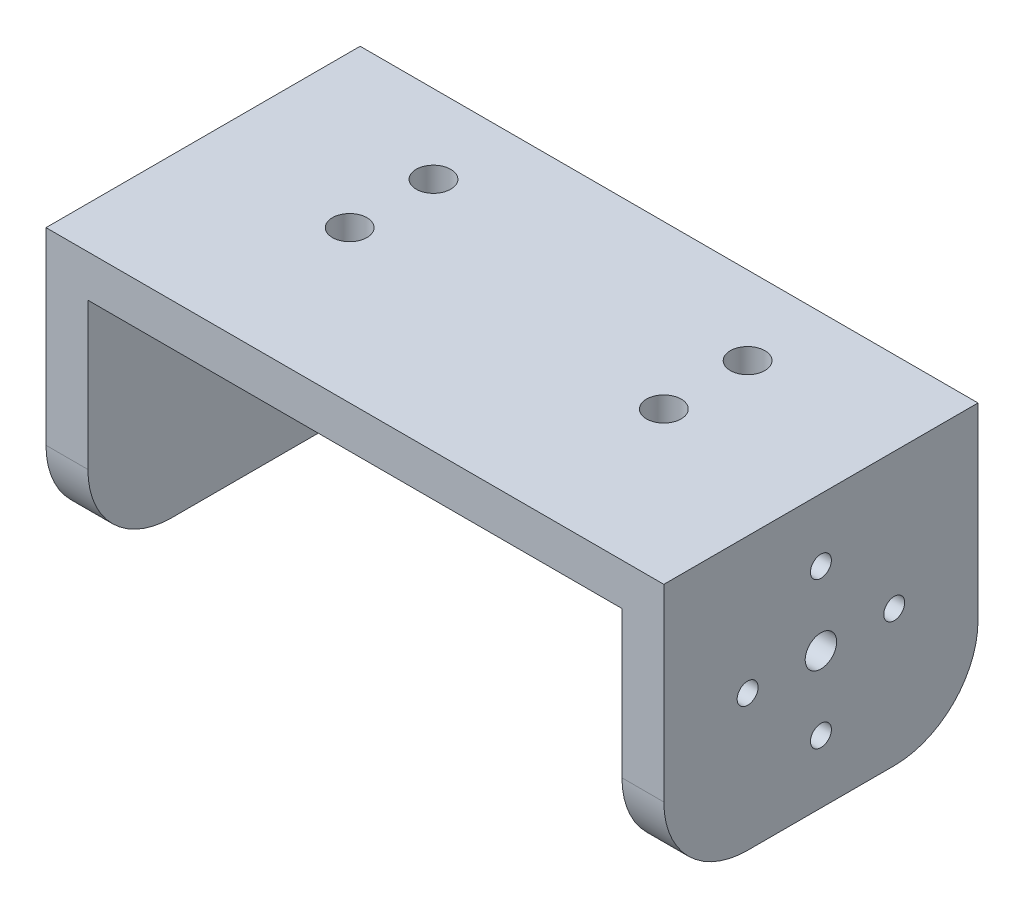
ISO-10303-21;
HEADER;
FILE_DESCRIPTION(('STEP AP214'),'2;1');
FILE_NAME('part.step','',(''),(''),'','','');
FILE_SCHEMA(('AUTOMOTIVE_DESIGN { 1 0 10303 214 1 1 1 1 }'));
ENDSEC;
DATA;
#1=APPLICATION_CONTEXT('core data for automotive mechanical design processes');
#2=APPLICATION_PROTOCOL_DEFINITION('international standard','automotive_design',2000,#1);
#3=PRODUCT_CONTEXT('',#1,'mechanical');
#4=PRODUCT('Part','Part','',(#3));
#5=PRODUCT_RELATED_PRODUCT_CATEGORY('part','',(#4));
#6=PRODUCT_DEFINITION_FORMATION('','',#4);
#7=PRODUCT_DEFINITION_CONTEXT('part definition',#1,'design');
#8=PRODUCT_DEFINITION('design','',#6,#7);
#9=PRODUCT_DEFINITION_SHAPE('','',#8);
#10=(LENGTH_UNIT() NAMED_UNIT(*) SI_UNIT(.MILLI.,.METRE.));
#11=(NAMED_UNIT(*) PLANE_ANGLE_UNIT() SI_UNIT($,.RADIAN.));
#12=(NAMED_UNIT(*) SI_UNIT($,.STERADIAN.) SOLID_ANGLE_UNIT());
#13=UNCERTAINTY_MEASURE_WITH_UNIT(LENGTH_MEASURE(1.E-05),#10,'distance_accuracy_value','');
#14=(GEOMETRIC_REPRESENTATION_CONTEXT(3) GLOBAL_UNCERTAINTY_ASSIGNED_CONTEXT((#13)) GLOBAL_UNIT_ASSIGNED_CONTEXT((#10,
#11,#12)) REPRESENTATION_CONTEXT('',''));
#15=CARTESIAN_POINT('',(0.,0.,0.));
#16=DIRECTION('',(0.,0.,1.));
#17=DIRECTION('',(1.,0.,0.));
#18=AXIS2_PLACEMENT_3D('',#15,#16,#17);
#19=CARTESIAN_POINT('',(29.5,0.,30.));
#20=DIRECTION('',(-1.,0.,0.));
#21=DIRECTION('',(0.,0.,1.));
#22=AXIS2_PLACEMENT_3D('',#19,#20,#21);
#23=PLANE('',#22);
#24=CARTESIAN_POINT('',(29.5,-13.,15.));
#25=DIRECTION('',(1.,0.,0.));
#26=DIRECTION('',(0.,0.,-1.));
#27=AXIS2_PLACEMENT_3D('',#24,#25,#26);
#28=CIRCLE('',#27,1.5);
#29=CARTESIAN_POINT('',(29.5,-13.,13.5));
#30=VERTEX_POINT('',#29);
#31=EDGE_CURVE('E514',#30,#30,#28,.T.);
#32=ORIENTED_EDGE('',*,*,#31,.F.);
#33=EDGE_LOOP('',(#32));
#34=FACE_BOUND('',#33,.T.);
#35=CARTESIAN_POINT('',(29.5,-13.,8.));
#36=DIRECTION('',(1.,0.,0.));
#37=DIRECTION('',(0.,0.,-1.));
#38=AXIS2_PLACEMENT_3D('',#35,#36,#37);
#39=CIRCLE('',#38,1.);
#40=CARTESIAN_POINT('',(29.5,-13.,7.));
#41=VERTEX_POINT('',#40);
#42=EDGE_CURVE('E213',#41,#41,#39,.T.);
#43=ORIENTED_EDGE('',*,*,#42,.F.);
#44=EDGE_LOOP('',(#43));
#45=FACE_BOUND('',#44,.T.);
#46=CARTESIAN_POINT('',(29.5,-20.,15.));
#47=DIRECTION('',(1.,0.,0.));
#48=DIRECTION('',(0.,0.,-1.));
#49=AXIS2_PLACEMENT_3D('',#46,#47,#48);
#50=CIRCLE('',#49,1.);
#51=CARTESIAN_POINT('',(29.5,-20.,14.));
#52=VERTEX_POINT('',#51);
#53=EDGE_CURVE('E522',#52,#52,#50,.T.);
#54=ORIENTED_EDGE('',*,*,#53,.F.);
#55=EDGE_LOOP('',(#54));
#56=FACE_BOUND('',#55,.T.);
#57=CARTESIAN_POINT('',(29.5,-13.,22.));
#58=DIRECTION('',(1.,0.,0.));
#59=DIRECTION('',(0.,0.,-1.));
#60=AXIS2_PLACEMENT_3D('',#57,#58,#59);
#61=CIRCLE('',#60,1.);
#62=CARTESIAN_POINT('',(29.5,-13.,21.));
#63=VERTEX_POINT('',#62);
#64=EDGE_CURVE('E517',#63,#63,#61,.T.);
#65=ORIENTED_EDGE('',*,*,#64,.F.);
#66=EDGE_LOOP('',(#65));
#67=FACE_BOUND('',#66,.T.);
#68=CARTESIAN_POINT('',(29.5,-6.00000000000001,15.));
#69=DIRECTION('',(1.,0.,0.));
#70=DIRECTION('',(0.,0.,-1.));
#71=AXIS2_PLACEMENT_3D('',#68,#69,#70);
#72=CIRCLE('',#71,1.);
#73=CARTESIAN_POINT('',(29.5,-6.00000000000001,14.));
#74=VERTEX_POINT('',#73);
#75=EDGE_CURVE('E228',#74,#74,#72,.T.);
#76=ORIENTED_EDGE('',*,*,#75,.F.);
#77=EDGE_LOOP('',(#76));
#78=FACE_BOUND('',#77,.T.);
#79=DIRECTION('',(0.,0.,-1.));
#80=VECTOR('',#79,1.);
#81=CARTESIAN_POINT('',(29.5,-26.,30.));
#82=LINE('',#81,#80);
#83=CARTESIAN_POINT('',(29.5,-26.,22.));
#84=VERTEX_POINT('',#83);
#85=CARTESIAN_POINT('',(29.5,-26.,8.));
#86=VERTEX_POINT('',#85);
#87=EDGE_CURVE('E247',#84,#86,#82,.T.);
#88=ORIENTED_EDGE('',*,*,#87,.T.);
#89=CARTESIAN_POINT('',(29.5,-18.,8.));
#90=DIRECTION('',(-1.,0.,0.));
#91=DIRECTION('',(0.,0.,1.));
#92=AXIS2_PLACEMENT_3D('',#89,#90,#91);
#93=CIRCLE('',#92,8.);
#94=CARTESIAN_POINT('',(29.5,-18.,0.));
#95=VERTEX_POINT('',#94);
#96=EDGE_CURVE('E188',#86,#95,#93,.F.);
#97=ORIENTED_EDGE('',*,*,#96,.T.);
#98=DIRECTION('',(0.,1.,0.));
#99=VECTOR('',#98,1.);
#100=CARTESIAN_POINT('',(29.5,0.,0.));
#101=LINE('',#100,#99);
#102=CARTESIAN_POINT('',(29.5,0.,0.));
#103=VERTEX_POINT('',#102);
#104=EDGE_CURVE('E154',#95,#103,#101,.T.);
#105=ORIENTED_EDGE('',*,*,#104,.T.);
#106=DIRECTION('',(0.,0.,-1.));
#107=VECTOR('',#106,1.);
#108=CARTESIAN_POINT('',(29.5,0.,30.));
#109=LINE('',#108,#107);
#110=CARTESIAN_POINT('',(29.5,0.,30.));
#111=VERTEX_POINT('',#110);
#112=EDGE_CURVE('E146',#111,#103,#109,.T.);
#113=ORIENTED_EDGE('',*,*,#112,.F.);
#114=DIRECTION('',(0.,1.,0.));
#115=VECTOR('',#114,1.);
#116=CARTESIAN_POINT('',(29.5,0.,30.));
#117=LINE('',#116,#115);
#118=CARTESIAN_POINT('',(29.5,-18.,30.));
#119=VERTEX_POINT('',#118);
#120=EDGE_CURVE('E130',#119,#111,#117,.T.);
#121=ORIENTED_EDGE('',*,*,#120,.F.);
#122=CARTESIAN_POINT('',(29.5,-18.,22.));
#123=DIRECTION('',(-1.,0.,0.));
#124=DIRECTION('',(0.,0.,1.));
#125=AXIS2_PLACEMENT_3D('',#122,#123,#124);
#126=CIRCLE('',#125,8.);
#127=EDGE_CURVE('E186',#119,#84,#126,.F.);
#128=ORIENTED_EDGE('',*,*,#127,.T.);
#129=EDGE_LOOP('',(#88,#97,#105,#113,#121,#128));
#130=FACE_BOUND('',#129,.T.);
#131=ADVANCED_FACE('F39',(#34,#45,#56,#67,#78,#130),#23,.F.);
#132=CARTESIAN_POINT('',(0.,0.,30.));
#133=DIRECTION('',(0.,-1.,0.));
#134=DIRECTION('',(1.,0.,0.));
#135=AXIS2_PLACEMENT_3D('',#132,#133,#134);
#136=PLANE('',#135);
#137=CARTESIAN_POINT('',(15.,0.,15.5));
#138=DIRECTION('',(0.,1.,0.));
#139=DIRECTION('',(1.,0.,0.));
#140=AXIS2_PLACEMENT_3D('',#137,#138,#139);
#141=CIRCLE('',#140,1.65000000000001);
#142=CARTESIAN_POINT('',(16.65,0.,15.5));
#143=VERTEX_POINT('',#142);
#144=EDGE_CURVE('E207',#143,#143,#141,.T.);
#145=ORIENTED_EDGE('',*,*,#144,.F.);
#146=EDGE_LOOP('',(#145));
#147=FACE_BOUND('',#146,.T.);
#148=CARTESIAN_POINT('',(-15.,0.,15.5));
#149=DIRECTION('',(0.,1.,0.));
#150=DIRECTION('',(1.,0.,0.));
#151=AXIS2_PLACEMENT_3D('',#148,#149,#150);
#152=CIRCLE('',#151,1.65);
#153=CARTESIAN_POINT('',(-13.35,0.,15.5));
#154=VERTEX_POINT('',#153);
#155=EDGE_CURVE('E233',#154,#154,#152,.T.);
#156=ORIENTED_EDGE('',*,*,#155,.F.);
#157=EDGE_LOOP('',(#156));
#158=FACE_BOUND('',#157,.T.);
#159=CARTESIAN_POINT('',(-15.,0.,7.5));
#160=DIRECTION('',(0.,1.,0.));
#161=DIRECTION('',(-1.,0.,0.));
#162=AXIS2_PLACEMENT_3D('',#159,#160,#161);
#163=CIRCLE('',#162,1.65);
#164=CARTESIAN_POINT('',(-16.65,0.,7.5));
#165=VERTEX_POINT('',#164);
#166=EDGE_CURVE('E230',#165,#165,#163,.T.);
#167=ORIENTED_EDGE('',*,*,#166,.F.);
#168=EDGE_LOOP('',(#167));
#169=FACE_BOUND('',#168,.T.);
#170=CARTESIAN_POINT('',(15.,0.,7.5));
#171=DIRECTION('',(0.,1.,0.));
#172=DIRECTION('',(-1.,0.,0.));
#173=AXIS2_PLACEMENT_3D('',#170,#171,#172);
#174=CIRCLE('',#173,1.65000000000001);
#175=CARTESIAN_POINT('',(13.35,0.,7.5));
#176=VERTEX_POINT('',#175);
#177=EDGE_CURVE('E195',#176,#176,#174,.T.);
#178=ORIENTED_EDGE('',*,*,#177,.F.);
#179=EDGE_LOOP('',(#178));
#180=FACE_BOUND('',#179,.T.);
#181=DIRECTION('',(-1.,0.,0.));
#182=VECTOR('',#181,1.);
#183=CARTESIAN_POINT('',(0.,0.,0.));
#184=LINE('',#183,#182);
#185=CARTESIAN_POINT('',(-29.5,0.,0.));
#186=VERTEX_POINT('',#185);
#187=EDGE_CURVE('E249',#103,#186,#184,.T.);
#188=ORIENTED_EDGE('',*,*,#187,.T.);
#189=DIRECTION('',(0.,0.,-1.));
#190=VECTOR('',#189,1.);
#191=CARTESIAN_POINT('',(-29.5,0.,30.));
#192=LINE('',#191,#190);
#193=CARTESIAN_POINT('',(-29.5,0.,30.));
#194=VERTEX_POINT('',#193);
#195=EDGE_CURVE('E148',#194,#186,#192,.T.);
#196=ORIENTED_EDGE('',*,*,#195,.F.);
#197=DIRECTION('',(-1.,0.,0.));
#198=VECTOR('',#197,1.);
#199=CARTESIAN_POINT('',(0.,0.,30.));
#200=LINE('',#199,#198);
#201=EDGE_CURVE('E134',#111,#194,#200,.T.);
#202=ORIENTED_EDGE('',*,*,#201,.F.);
#203=ORIENTED_EDGE('',*,*,#112,.T.);
#204=EDGE_LOOP('',(#188,#196,#202,#203));
#205=FACE_BOUND('',#204,.T.);
#206=ADVANCED_FACE('F145',(#147,#158,#169,#180,#205),#136,.F.);
#207=CARTESIAN_POINT('',(-29.5,0.,30.));
#208=DIRECTION('',(1.,0.,0.));
#209=DIRECTION('',(0.,1.,0.));
#210=AXIS2_PLACEMENT_3D('',#207,#208,#209);
#211=PLANE('',#210);
#212=CARTESIAN_POINT('',(-29.5,-13.,15.));
#213=DIRECTION('',(-1.,0.,0.));
#214=DIRECTION('',(0.,-1.,0.));
#215=AXIS2_PLACEMENT_3D('',#212,#213,#214);
#216=CIRCLE('',#215,1.65);
#217=CARTESIAN_POINT('',(-29.5,-14.65,15.));
#218=VERTEX_POINT('',#217);
#219=EDGE_CURVE('E208',#218,#218,#216,.T.);
#220=ORIENTED_EDGE('',*,*,#219,.F.);
#221=EDGE_LOOP('',(#220));
#222=FACE_BOUND('',#221,.T.);
#223=DIRECTION('',(0.,0.,-1.));
#224=VECTOR('',#223,1.);
#225=CARTESIAN_POINT('',(-29.5,-26.,30.));
#226=LINE('',#225,#224);
#227=CARTESIAN_POINT('',(-29.5,-26.,22.));
#228=VERTEX_POINT('',#227);
#229=CARTESIAN_POINT('',(-29.5,-26.,8.));
#230=VERTEX_POINT('',#229);
#231=EDGE_CURVE('E159',#228,#230,#226,.T.);
#232=ORIENTED_EDGE('',*,*,#231,.F.);
#233=CARTESIAN_POINT('',(-29.5,-18.,22.));
#234=DIRECTION('',(1.,0.,0.));
#235=DIRECTION('',(0.,1.,0.));
#236=AXIS2_PLACEMENT_3D('',#233,#234,#235);
#237=CIRCLE('',#236,8.);
#238=CARTESIAN_POINT('',(-29.5,-18.,30.));
#239=VERTEX_POINT('',#238);
#240=EDGE_CURVE('E176',#228,#239,#237,.F.);
#241=ORIENTED_EDGE('',*,*,#240,.T.);
#242=DIRECTION('',(0.,-1.,0.));
#243=VECTOR('',#242,1.);
#244=CARTESIAN_POINT('',(-29.5,0.,30.));
#245=LINE('',#244,#243);
#246=EDGE_CURVE('E150',#194,#239,#245,.T.);
#247=ORIENTED_EDGE('',*,*,#246,.F.);
#248=ORIENTED_EDGE('',*,*,#195,.T.);
#249=DIRECTION('',(0.,-1.,0.));
#250=VECTOR('',#249,1.);
#251=CARTESIAN_POINT('',(-29.5,0.,0.));
#252=LINE('',#251,#250);
#253=CARTESIAN_POINT('',(-29.5,-18.,0.));
#254=VERTEX_POINT('',#253);
#255=EDGE_CURVE('E251',#186,#254,#252,.T.);
#256=ORIENTED_EDGE('',*,*,#255,.T.);
#257=CARTESIAN_POINT('',(-29.5,-18.,8.));
#258=DIRECTION('',(1.,0.,0.));
#259=DIRECTION('',(0.,1.,0.));
#260=AXIS2_PLACEMENT_3D('',#257,#258,#259);
#261=CIRCLE('',#260,8.);
#262=EDGE_CURVE('E174',#254,#230,#261,.F.);
#263=ORIENTED_EDGE('',*,*,#262,.T.);
#264=EDGE_LOOP('',(#232,#241,#247,#248,#256,#263));
#265=FACE_BOUND('',#264,.T.);
#266=ADVANCED_FACE('F300',(#222,#265),#211,.F.);
#267=CARTESIAN_POINT('',(-25.5,-26.,30.));
#268=DIRECTION('',(0.,1.,0.));
#269=DIRECTION('',(0.,0.,1.));
#270=AXIS2_PLACEMENT_3D('',#267,#268,#269);
#271=PLANE('',#270);
#272=DIRECTION('',(0.,0.,-1.));
#273=VECTOR('',#272,1.);
#274=CARTESIAN_POINT('',(-25.5,-26.,30.));
#275=LINE('',#274,#273);
#276=CARTESIAN_POINT('',(-25.5,-26.,22.));
#277=VERTEX_POINT('',#276);
#278=CARTESIAN_POINT('',(-25.5,-26.,8.));
#279=VERTEX_POINT('',#278);
#280=EDGE_CURVE('E268',#277,#279,#275,.T.);
#281=ORIENTED_EDGE('',*,*,#280,.F.);
#282=DIRECTION('',(1.,0.,0.));
#283=VECTOR('',#282,1.);
#284=CARTESIAN_POINT('',(-29.5,-26.,22.));
#285=LINE('',#284,#283);
#286=EDGE_CURVE('E172',#277,#228,#285,.F.);
#287=ORIENTED_EDGE('',*,*,#286,.T.);
#288=ORIENTED_EDGE('',*,*,#231,.T.);
#289=DIRECTION('',(1.,0.,0.));
#290=VECTOR('',#289,1.);
#291=CARTESIAN_POINT('',(-25.5,-26.,8.));
#292=LINE('',#291,#290);
#293=EDGE_CURVE('E169',#230,#279,#292,.T.);
#294=ORIENTED_EDGE('',*,*,#293,.T.);
#295=EDGE_LOOP('',(#281,#287,#288,#294));
#296=FACE_BOUND('',#295,.T.);
#297=ADVANCED_FACE('F275',(#296),#271,.F.);
#298=CARTESIAN_POINT('',(-25.5,-4.00000000000001,30.));
#299=DIRECTION('',(-1.,0.,0.));
#300=DIRECTION('',(0.,0.,1.));
#301=AXIS2_PLACEMENT_3D('',#298,#299,#300);
#302=PLANE('',#301);
#303=CARTESIAN_POINT('',(-25.5,-13.,15.));
#304=DIRECTION('',(-1.,0.,0.));
#305=DIRECTION('',(0.,0.,1.));
#306=AXIS2_PLACEMENT_3D('',#303,#304,#305);
#307=CIRCLE('',#306,1.65);
#308=CARTESIAN_POINT('',(-25.5,-13.,16.65));
#309=VERTEX_POINT('',#308);
#310=EDGE_CURVE('E204',#309,#309,#307,.T.);
#311=ORIENTED_EDGE('',*,*,#310,.T.);
#312=EDGE_LOOP('',(#311));
#313=FACE_BOUND('',#312,.T.);
#314=DIRECTION('',(0.,1.,0.));
#315=VECTOR('',#314,1.);
#316=CARTESIAN_POINT('',(-25.5,-4.00000000000001,30.));
#317=LINE('',#316,#315);
#318=CARTESIAN_POINT('',(-25.5,-18.,30.));
#319=VERTEX_POINT('',#318);
#320=CARTESIAN_POINT('',(-25.5,-4.00000000000001,30.));
#321=VERTEX_POINT('',#320);
#322=EDGE_CURVE('E241',#319,#321,#317,.T.);
#323=ORIENTED_EDGE('',*,*,#322,.F.);
#324=CARTESIAN_POINT('',(-25.5,-18.,22.));
#325=DIRECTION('',(-1.,0.,0.));
#326=DIRECTION('',(0.,0.,1.));
#327=AXIS2_PLACEMENT_3D('',#324,#325,#326);
#328=CIRCLE('',#327,8.);
#329=EDGE_CURVE('E167',#319,#277,#328,.F.);
#330=ORIENTED_EDGE('',*,*,#329,.T.);
#331=ORIENTED_EDGE('',*,*,#280,.T.);
#332=CARTESIAN_POINT('',(-25.5,-18.,8.));
#333=DIRECTION('',(-1.,0.,0.));
#334=DIRECTION('',(0.,0.,1.));
#335=AXIS2_PLACEMENT_3D('',#332,#333,#334);
#336=CIRCLE('',#335,8.);
#337=CARTESIAN_POINT('',(-25.5,-18.,0.));
#338=VERTEX_POINT('',#337);
#339=EDGE_CURVE('E165',#279,#338,#336,.F.);
#340=ORIENTED_EDGE('',*,*,#339,.T.);
#341=DIRECTION('',(0.,1.,0.));
#342=VECTOR('',#341,1.);
#343=CARTESIAN_POINT('',(-25.5,-4.00000000000001,0.));
#344=LINE('',#343,#342);
#345=CARTESIAN_POINT('',(-25.5,-4.00000000000001,0.));
#346=VERTEX_POINT('',#345);
#347=EDGE_CURVE('E254',#338,#346,#344,.T.);
#348=ORIENTED_EDGE('',*,*,#347,.T.);
#349=DIRECTION('',(0.,0.,-1.));
#350=VECTOR('',#349,1.);
#351=CARTESIAN_POINT('',(-25.5,-4.00000000000001,30.));
#352=LINE('',#351,#350);
#353=EDGE_CURVE('E265',#321,#346,#352,.T.);
#354=ORIENTED_EDGE('',*,*,#353,.F.);
#355=EDGE_LOOP('',(#323,#330,#331,#340,#348,#354));
#356=FACE_BOUND('',#355,.T.);
#357=ADVANCED_FACE('F286',(#313,#356),#302,.F.);
#358=CARTESIAN_POINT('',(0.,-4.,30.));
#359=DIRECTION('',(0.,1.,0.));
#360=DIRECTION('',(0.,0.,1.));
#361=AXIS2_PLACEMENT_3D('',#358,#359,#360);
#362=PLANE('',#361);
#363=CARTESIAN_POINT('',(15.,-4.,15.5));
#364=DIRECTION('',(0.,1.,0.));
#365=DIRECTION('',(0.,0.,1.));
#366=AXIS2_PLACEMENT_3D('',#363,#364,#365);
#367=CIRCLE('',#366,1.65000000000001);
#368=CARTESIAN_POINT('',(15.,-4.,17.15));
#369=VERTEX_POINT('',#368);
#370=EDGE_CURVE('E201',#369,#369,#367,.T.);
#371=ORIENTED_EDGE('',*,*,#370,.T.);
#372=EDGE_LOOP('',(#371));
#373=FACE_BOUND('',#372,.T.);
#374=CARTESIAN_POINT('',(-15.,-4.,15.5));
#375=DIRECTION('',(0.,1.,0.));
#376=DIRECTION('',(0.,0.,1.));
#377=AXIS2_PLACEMENT_3D('',#374,#375,#376);
#378=CIRCLE('',#377,1.65);
#379=CARTESIAN_POINT('',(-15.,-4.,17.15));
#380=VERTEX_POINT('',#379);
#381=EDGE_CURVE('E198',#380,#380,#378,.T.);
#382=ORIENTED_EDGE('',*,*,#381,.T.);
#383=EDGE_LOOP('',(#382));
#384=FACE_BOUND('',#383,.T.);
#385=CARTESIAN_POINT('',(-15.,-4.,7.5));
#386=DIRECTION('',(0.,1.,0.));
#387=DIRECTION('',(0.,0.,1.));
#388=AXIS2_PLACEMENT_3D('',#385,#386,#387);
#389=CIRCLE('',#388,1.65);
#390=CARTESIAN_POINT('',(-15.,-4.,9.15));
#391=VERTEX_POINT('',#390);
#392=EDGE_CURVE('E194',#391,#391,#389,.T.);
#393=ORIENTED_EDGE('',*,*,#392,.T.);
#394=EDGE_LOOP('',(#393));
#395=FACE_BOUND('',#394,.T.);
#396=CARTESIAN_POINT('',(15.,-4.,7.5));
#397=DIRECTION('',(0.,1.,0.));
#398=DIRECTION('',(0.,0.,1.));
#399=AXIS2_PLACEMENT_3D('',#396,#397,#398);
#400=CIRCLE('',#399,1.65000000000001);
#401=CARTESIAN_POINT('',(15.,-4.,9.15));
#402=VERTEX_POINT('',#401);
#403=EDGE_CURVE('E191',#402,#402,#400,.T.);
#404=ORIENTED_EDGE('',*,*,#403,.T.);
#405=EDGE_LOOP('',(#404));
#406=FACE_BOUND('',#405,.T.);
#407=DIRECTION('',(1.,0.,0.));
#408=VECTOR('',#407,1.);
#409=CARTESIAN_POINT('',(0.,-4.,0.));
#410=LINE('',#409,#408);
#411=CARTESIAN_POINT('',(25.5,-4.,0.));
#412=VERTEX_POINT('',#411);
#413=EDGE_CURVE('E256',#346,#412,#410,.T.);
#414=ORIENTED_EDGE('',*,*,#413,.T.);
#415=DIRECTION('',(0.,0.,-1.));
#416=VECTOR('',#415,1.);
#417=CARTESIAN_POINT('',(25.5,-4.,30.));
#418=LINE('',#417,#416);
#419=CARTESIAN_POINT('',(25.5,-4.,30.));
#420=VERTEX_POINT('',#419);
#421=EDGE_CURVE('E262',#420,#412,#418,.T.);
#422=ORIENTED_EDGE('',*,*,#421,.F.);
#423=DIRECTION('',(1.,0.,0.));
#424=VECTOR('',#423,1.);
#425=CARTESIAN_POINT('',(0.,-4.,30.));
#426=LINE('',#425,#424);
#427=EDGE_CURVE('E243',#321,#420,#426,.T.);
#428=ORIENTED_EDGE('',*,*,#427,.F.);
#429=ORIENTED_EDGE('',*,*,#353,.T.);
#430=EDGE_LOOP('',(#414,#422,#428,#429));
#431=FACE_BOUND('',#430,.T.);
#432=ADVANCED_FACE('F296',(#373,#384,#395,#406,#431),#362,.F.);
#433=CARTESIAN_POINT('',(25.5,-4.,30.));
#434=DIRECTION('',(1.,0.,0.));
#435=DIRECTION('',(0.,1.,0.));
#436=AXIS2_PLACEMENT_3D('',#433,#434,#435);
#437=PLANE('',#436);
#438=CARTESIAN_POINT('',(25.5,-13.,15.));
#439=DIRECTION('',(1.,0.,0.));
#440=DIRECTION('',(0.,1.,0.));
#441=AXIS2_PLACEMENT_3D('',#438,#439,#440);
#442=CIRCLE('',#441,1.5);
#443=CARTESIAN_POINT('',(25.5,-11.5,15.));
#444=VERTEX_POINT('',#443);
#445=EDGE_CURVE('E43',#444,#444,#442,.T.);
#446=ORIENTED_EDGE('',*,*,#445,.T.);
#447=EDGE_LOOP('',(#446));
#448=FACE_BOUND('',#447,.T.);
#449=CARTESIAN_POINT('',(25.5,-13.,8.));
#450=DIRECTION('',(1.,0.,0.));
#451=DIRECTION('',(0.,1.,0.));
#452=AXIS2_PLACEMENT_3D('',#449,#450,#451);
#453=CIRCLE('',#452,1.);
#454=CARTESIAN_POINT('',(25.5,-12.,8.));
#455=VERTEX_POINT('',#454);
#456=EDGE_CURVE('E218',#455,#455,#453,.T.);
#457=ORIENTED_EDGE('',*,*,#456,.T.);
#458=EDGE_LOOP('',(#457));
#459=FACE_BOUND('',#458,.T.);
#460=CARTESIAN_POINT('',(25.5,-20.,15.));
#461=DIRECTION('',(1.,0.,0.));
#462=DIRECTION('',(0.,1.,0.));
#463=AXIS2_PLACEMENT_3D('',#460,#461,#462);
#464=CIRCLE('',#463,1.);
#465=CARTESIAN_POINT('',(25.5,-19.,15.));
#466=VERTEX_POINT('',#465);
#467=EDGE_CURVE('E216',#466,#466,#464,.T.);
#468=ORIENTED_EDGE('',*,*,#467,.T.);
#469=EDGE_LOOP('',(#468));
#470=FACE_BOUND('',#469,.T.);
#471=CARTESIAN_POINT('',(25.5,-13.,22.));
#472=DIRECTION('',(1.,0.,0.));
#473=DIRECTION('',(0.,1.,0.));
#474=AXIS2_PLACEMENT_3D('',#471,#472,#473);
#475=CIRCLE('',#474,1.);
#476=CARTESIAN_POINT('',(25.5,-12.,22.));
#477=VERTEX_POINT('',#476);
#478=EDGE_CURVE('E212',#477,#477,#475,.T.);
#479=ORIENTED_EDGE('',*,*,#478,.T.);
#480=EDGE_LOOP('',(#479));
#481=FACE_BOUND('',#480,.T.);
#482=CARTESIAN_POINT('',(25.5,-6.00000000000001,15.));
#483=DIRECTION('',(1.,0.,0.));
#484=DIRECTION('',(0.,1.,0.));
#485=AXIS2_PLACEMENT_3D('',#482,#483,#484);
#486=CIRCLE('',#485,1.);
#487=CARTESIAN_POINT('',(25.5,-5.,15.));
#488=VERTEX_POINT('',#487);
#489=EDGE_CURVE('E209',#488,#488,#486,.T.);
#490=ORIENTED_EDGE('',*,*,#489,.T.);
#491=EDGE_LOOP('',(#490));
#492=FACE_BOUND('',#491,.T.);
#493=DIRECTION('',(0.,-1.,0.));
#494=VECTOR('',#493,1.);
#495=CARTESIAN_POINT('',(25.5,-4.,0.));
#496=LINE('',#495,#494);
#497=CARTESIAN_POINT('',(25.5,-18.,0.));
#498=VERTEX_POINT('',#497);
#499=EDGE_CURVE('E141',#412,#498,#496,.T.);
#500=ORIENTED_EDGE('',*,*,#499,.T.);
#501=CARTESIAN_POINT('',(25.5,-18.,8.));
#502=DIRECTION('',(1.,0.,0.));
#503=DIRECTION('',(0.,1.,0.));
#504=AXIS2_PLACEMENT_3D('',#501,#502,#503);
#505=CIRCLE('',#504,8.);
#506=CARTESIAN_POINT('',(25.5,-26.,8.));
#507=VERTEX_POINT('',#506);
#508=EDGE_CURVE('E11',#498,#507,#505,.F.);
#509=ORIENTED_EDGE('',*,*,#508,.T.);
#510=DIRECTION('',(0.,0.,-1.));
#511=VECTOR('',#510,1.);
#512=CARTESIAN_POINT('',(25.5,-26.,30.));
#513=LINE('',#512,#511);
#514=CARTESIAN_POINT('',(25.5,-26.,22.));
#515=VERTEX_POINT('',#514);
#516=EDGE_CURVE('E260',#515,#507,#513,.T.);
#517=ORIENTED_EDGE('',*,*,#516,.F.);
#518=CARTESIAN_POINT('',(25.5,-18.,22.));
#519=DIRECTION('',(1.,0.,0.));
#520=DIRECTION('',(0.,1.,0.));
#521=AXIS2_PLACEMENT_3D('',#518,#519,#520);
#522=CIRCLE('',#521,8.);
#523=CARTESIAN_POINT('',(25.5,-18.,30.));
#524=VERTEX_POINT('',#523);
#525=EDGE_CURVE('E48',#515,#524,#522,.F.);
#526=ORIENTED_EDGE('',*,*,#525,.T.);
#527=DIRECTION('',(0.,-1.,0.));
#528=VECTOR('',#527,1.);
#529=CARTESIAN_POINT('',(25.5,-4.,30.));
#530=LINE('',#529,#528);
#531=EDGE_CURVE('E245',#420,#524,#530,.T.);
#532=ORIENTED_EDGE('',*,*,#531,.F.);
#533=ORIENTED_EDGE('',*,*,#421,.T.);
#534=EDGE_LOOP('',(#500,#509,#517,#526,#532,#533));
#535=FACE_BOUND('',#534,.T.);
#536=ADVANCED_FACE('F309',(#448,#459,#470,#481,#492,#535),#437,.F.);
#537=CARTESIAN_POINT('',(25.5,-26.,30.));
#538=DIRECTION('',(0.,1.,0.));
#539=DIRECTION('',(0.,0.,1.));
#540=AXIS2_PLACEMENT_3D('',#537,#538,#539);
#541=PLANE('',#540);
#542=ORIENTED_EDGE('',*,*,#516,.T.);
#543=DIRECTION('',(1.,0.,0.));
#544=VECTOR('',#543,1.);
#545=CARTESIAN_POINT('',(25.5,-26.,8.));
#546=LINE('',#545,#544);
#547=EDGE_CURVE('E183',#507,#86,#546,.T.);
#548=ORIENTED_EDGE('',*,*,#547,.T.);
#549=ORIENTED_EDGE('',*,*,#87,.F.);
#550=DIRECTION('',(1.,0.,0.));
#551=VECTOR('',#550,1.);
#552=CARTESIAN_POINT('',(25.5,-26.,22.));
#553=LINE('',#552,#551);
#554=EDGE_CURVE('E61',#84,#515,#553,.F.);
#555=ORIENTED_EDGE('',*,*,#554,.T.);
#556=EDGE_LOOP('',(#542,#548,#549,#555));
#557=FACE_BOUND('',#556,.T.);
#558=ADVANCED_FACE('F305',(#557),#541,.F.);
#559=CARTESIAN_POINT('',(0.,0.,30.));
#560=DIRECTION('',(0.,0.,1.));
#561=DIRECTION('',(1.,0.,0.));
#562=AXIS2_PLACEMENT_3D('',#559,#560,#561);
#563=PLANE('',#562);
#564=ORIENTED_EDGE('',*,*,#246,.T.);
#565=DIRECTION('',(1.,0.,0.));
#566=VECTOR('',#565,1.);
#567=CARTESIAN_POINT('',(-25.5,-18.,30.));
#568=LINE('',#567,#566);
#569=EDGE_CURVE('E157',#239,#319,#568,.T.);
#570=ORIENTED_EDGE('',*,*,#569,.T.);
#571=ORIENTED_EDGE('',*,*,#322,.T.);
#572=ORIENTED_EDGE('',*,*,#427,.T.);
#573=ORIENTED_EDGE('',*,*,#531,.T.);
#574=DIRECTION('',(1.,0.,0.));
#575=VECTOR('',#574,1.);
#576=CARTESIAN_POINT('',(29.5,-18.,30.));
#577=LINE('',#576,#575);
#578=EDGE_CURVE('E138',#524,#119,#577,.T.);
#579=ORIENTED_EDGE('',*,*,#578,.T.);
#580=ORIENTED_EDGE('',*,*,#120,.T.);
#581=ORIENTED_EDGE('',*,*,#201,.T.);
#582=EDGE_LOOP('',(#564,#570,#571,#572,#573,#579,#580,#581));
#583=FACE_BOUND('',#582,.T.);
#584=ADVANCED_FACE('F133',(#583),#563,.T.);
#585=CARTESIAN_POINT('',(0.,0.,0.));
#586=DIRECTION('',(0.,0.,1.));
#587=DIRECTION('',(1.,0.,0.));
#588=AXIS2_PLACEMENT_3D('',#585,#586,#587);
#589=PLANE('',#588);
#590=ORIENTED_EDGE('',*,*,#347,.F.);
#591=DIRECTION('',(1.,0.,0.));
#592=VECTOR('',#591,1.);
#593=CARTESIAN_POINT('',(0.,-18.,0.));
#594=LINE('',#593,#592);
#595=EDGE_CURVE('E180',#338,#254,#594,.F.);
#596=ORIENTED_EDGE('',*,*,#595,.T.);
#597=ORIENTED_EDGE('',*,*,#255,.F.);
#598=ORIENTED_EDGE('',*,*,#187,.F.);
#599=ORIENTED_EDGE('',*,*,#104,.F.);
#600=DIRECTION('',(1.,0.,0.));
#601=VECTOR('',#600,1.);
#602=CARTESIAN_POINT('',(0.,-18.,0.));
#603=LINE('',#602,#601);
#604=EDGE_CURVE('E178',#95,#498,#603,.F.);
#605=ORIENTED_EDGE('',*,*,#604,.T.);
#606=ORIENTED_EDGE('',*,*,#499,.F.);
#607=ORIENTED_EDGE('',*,*,#413,.F.);
#608=EDGE_LOOP('',(#590,#596,#597,#598,#599,#605,#606,#607));
#609=FACE_BOUND('',#608,.T.);
#610=ADVANCED_FACE('F290',(#609),#589,.F.);
#611=CARTESIAN_POINT('',(0.,-18.,22.));
#612=DIRECTION('',(-1.,0.,0.));
#613=DIRECTION('',(0.,0.,1.));
#614=AXIS2_PLACEMENT_3D('',#611,#612,#613);
#615=CYLINDRICAL_SURFACE('',#614,8.);
#616=ORIENTED_EDGE('',*,*,#240,.F.);
#617=ORIENTED_EDGE('',*,*,#286,.F.);
#618=ORIENTED_EDGE('',*,*,#329,.F.);
#619=ORIENTED_EDGE('',*,*,#569,.F.);
#620=EDGE_LOOP('',(#616,#617,#618,#619));
#621=FACE_BOUND('',#620,.T.);
#622=ADVANCED_FACE('F299',(#621),#615,.T.);
#623=CARTESIAN_POINT('',(-25.5,-18.,8.));
#624=DIRECTION('',(1.,0.,0.));
#625=DIRECTION('',(0.,0.,-1.));
#626=AXIS2_PLACEMENT_3D('',#623,#624,#625);
#627=CYLINDRICAL_SURFACE('',#626,8.);
#628=ORIENTED_EDGE('',*,*,#262,.F.);
#629=ORIENTED_EDGE('',*,*,#595,.F.);
#630=ORIENTED_EDGE('',*,*,#339,.F.);
#631=ORIENTED_EDGE('',*,*,#293,.F.);
#632=EDGE_LOOP('',(#628,#629,#630,#631));
#633=FACE_BOUND('',#632,.T.);
#634=ADVANCED_FACE('F281',(#633),#627,.T.);
#635=CARTESIAN_POINT('',(25.5,-18.,8.));
#636=DIRECTION('',(1.,0.,0.));
#637=DIRECTION('',(0.,0.,-1.));
#638=AXIS2_PLACEMENT_3D('',#635,#636,#637);
#639=CYLINDRICAL_SURFACE('',#638,8.);
#640=ORIENTED_EDGE('',*,*,#508,.F.);
#641=ORIENTED_EDGE('',*,*,#604,.F.);
#642=ORIENTED_EDGE('',*,*,#96,.F.);
#643=ORIENTED_EDGE('',*,*,#547,.F.);
#644=EDGE_LOOP('',(#640,#641,#642,#643));
#645=FACE_BOUND('',#644,.T.);
#646=ADVANCED_FACE('F303',(#645),#639,.T.);
#647=CARTESIAN_POINT('',(0.,-18.,22.));
#648=DIRECTION('',(-1.,0.,0.));
#649=DIRECTION('',(0.,0.,1.));
#650=AXIS2_PLACEMENT_3D('',#647,#648,#649);
#651=CYLINDRICAL_SURFACE('',#650,8.);
#652=ORIENTED_EDGE('',*,*,#525,.F.);
#653=ORIENTED_EDGE('',*,*,#554,.F.);
#654=ORIENTED_EDGE('',*,*,#127,.F.);
#655=ORIENTED_EDGE('',*,*,#578,.F.);
#656=EDGE_LOOP('',(#652,#653,#654,#655));
#657=FACE_BOUND('',#656,.T.);
#658=ADVANCED_FACE('F41',(#657),#651,.T.);
#659=CARTESIAN_POINT('',(15.,-10.,7.5));
#660=DIRECTION('',(0.,1.,0.));
#661=DIRECTION('',(-1.,0.,0.));
#662=AXIS2_PLACEMENT_3D('',#659,#660,#661);
#663=CYLINDRICAL_SURFACE('',#662,1.65000000000001);
#664=ORIENTED_EDGE('',*,*,#177,.T.);
#665=EDGE_LOOP('',(#664));
#666=FACE_BOUND('',#665,.T.);
#667=ORIENTED_EDGE('',*,*,#403,.F.);
#668=EDGE_LOOP('',(#667));
#669=FACE_BOUND('',#668,.T.);
#670=ADVANCED_FACE('F340',(#666,#669),#663,.F.);
#671=CARTESIAN_POINT('',(-15.,-10.,7.5));
#672=DIRECTION('',(0.,1.,0.));
#673=DIRECTION('',(-1.,0.,0.));
#674=AXIS2_PLACEMENT_3D('',#671,#672,#673);
#675=CYLINDRICAL_SURFACE('',#674,1.65);
#676=ORIENTED_EDGE('',*,*,#166,.T.);
#677=EDGE_LOOP('',(#676));
#678=FACE_BOUND('',#677,.T.);
#679=ORIENTED_EDGE('',*,*,#392,.F.);
#680=EDGE_LOOP('',(#679));
#681=FACE_BOUND('',#680,.T.);
#682=ADVANCED_FACE('F344',(#678,#681),#675,.F.);
#683=CARTESIAN_POINT('',(-15.,-10.,15.5));
#684=DIRECTION('',(0.,1.,0.));
#685=DIRECTION('',(-1.,0.,0.));
#686=AXIS2_PLACEMENT_3D('',#683,#684,#685);
#687=CYLINDRICAL_SURFACE('',#686,1.65);
#688=ORIENTED_EDGE('',*,*,#155,.T.);
#689=EDGE_LOOP('',(#688));
#690=FACE_BOUND('',#689,.T.);
#691=ORIENTED_EDGE('',*,*,#381,.F.);
#692=EDGE_LOOP('',(#691));
#693=FACE_BOUND('',#692,.T.);
#694=ADVANCED_FACE('F350',(#690,#693),#687,.F.);
#695=CARTESIAN_POINT('',(15.,-10.,15.5));
#696=DIRECTION('',(0.,1.,0.));
#697=DIRECTION('',(-1.,0.,0.));
#698=AXIS2_PLACEMENT_3D('',#695,#696,#697);
#699=CYLINDRICAL_SURFACE('',#698,1.65000000000001);
#700=ORIENTED_EDGE('',*,*,#144,.T.);
#701=EDGE_LOOP('',(#700));
#702=FACE_BOUND('',#701,.T.);
#703=ORIENTED_EDGE('',*,*,#370,.F.);
#704=EDGE_LOOP('',(#703));
#705=FACE_BOUND('',#704,.T.);
#706=ADVANCED_FACE('F356',(#702,#705),#699,.F.);
#707=CARTESIAN_POINT('',(-19.5,-13.,15.));
#708=DIRECTION('',(-1.,0.,0.));
#709=DIRECTION('',(0.,-1.,0.));
#710=AXIS2_PLACEMENT_3D('',#707,#708,#709);
#711=CYLINDRICAL_SURFACE('',#710,1.65);
#712=ORIENTED_EDGE('',*,*,#219,.T.);
#713=EDGE_LOOP('',(#712));
#714=FACE_BOUND('',#713,.T.);
#715=ORIENTED_EDGE('',*,*,#310,.F.);
#716=EDGE_LOOP('',(#715));
#717=FACE_BOUND('',#716,.T.);
#718=ADVANCED_FACE('F426',(#714,#717),#711,.F.);
#719=CARTESIAN_POINT('',(19.5,-6.00000000000001,15.));
#720=DIRECTION('',(1.,0.,0.));
#721=DIRECTION('',(0.,0.,-1.));
#722=AXIS2_PLACEMENT_3D('',#719,#720,#721);
#723=CYLINDRICAL_SURFACE('',#722,1.);
#724=ORIENTED_EDGE('',*,*,#75,.T.);
#725=EDGE_LOOP('',(#724));
#726=FACE_BOUND('',#725,.T.);
#727=ORIENTED_EDGE('',*,*,#489,.F.);
#728=EDGE_LOOP('',(#727));
#729=FACE_BOUND('',#728,.T.);
#730=ADVANCED_FACE('F451',(#726,#729),#723,.F.);
#731=CARTESIAN_POINT('',(19.5,-13.,22.));
#732=DIRECTION('',(1.,0.,0.));
#733=DIRECTION('',(0.,0.,-1.));
#734=AXIS2_PLACEMENT_3D('',#731,#732,#733);
#735=CYLINDRICAL_SURFACE('',#734,1.);
#736=ORIENTED_EDGE('',*,*,#64,.T.);
#737=EDGE_LOOP('',(#736));
#738=FACE_BOUND('',#737,.T.);
#739=ORIENTED_EDGE('',*,*,#478,.F.);
#740=EDGE_LOOP('',(#739));
#741=FACE_BOUND('',#740,.T.);
#742=ADVANCED_FACE('F460',(#738,#741),#735,.F.);
#743=CARTESIAN_POINT('',(19.5,-20.,15.));
#744=DIRECTION('',(1.,0.,0.));
#745=DIRECTION('',(0.,0.,-1.));
#746=AXIS2_PLACEMENT_3D('',#743,#744,#745);
#747=CYLINDRICAL_SURFACE('',#746,1.);
#748=ORIENTED_EDGE('',*,*,#53,.T.);
#749=EDGE_LOOP('',(#748));
#750=FACE_BOUND('',#749,.T.);
#751=ORIENTED_EDGE('',*,*,#467,.F.);
#752=EDGE_LOOP('',(#751));
#753=FACE_BOUND('',#752,.T.);
#754=ADVANCED_FACE('F470',(#750,#753),#747,.F.);
#755=CARTESIAN_POINT('',(19.5,-13.,8.));
#756=DIRECTION('',(1.,0.,0.));
#757=DIRECTION('',(0.,0.,-1.));
#758=AXIS2_PLACEMENT_3D('',#755,#756,#757);
#759=CYLINDRICAL_SURFACE('',#758,1.);
#760=ORIENTED_EDGE('',*,*,#42,.T.);
#761=EDGE_LOOP('',(#760));
#762=FACE_BOUND('',#761,.T.);
#763=ORIENTED_EDGE('',*,*,#456,.F.);
#764=EDGE_LOOP('',(#763));
#765=FACE_BOUND('',#764,.T.);
#766=ADVANCED_FACE('F480',(#762,#765),#759,.F.);
#767=CARTESIAN_POINT('',(19.5,-13.,15.));
#768=DIRECTION('',(1.,0.,0.));
#769=DIRECTION('',(0.,0.,-1.));
#770=AXIS2_PLACEMENT_3D('',#767,#768,#769);
#771=CYLINDRICAL_SURFACE('',#770,1.5);
#772=ORIENTED_EDGE('',*,*,#31,.T.);
#773=EDGE_LOOP('',(#772));
#774=FACE_BOUND('',#773,.T.);
#775=ORIENTED_EDGE('',*,*,#445,.F.);
#776=EDGE_LOOP('',(#775));
#777=FACE_BOUND('',#776,.T.);
#778=ADVANCED_FACE('F489',(#774,#777),#771,.F.);
#779=CLOSED_SHELL('',(#131,#206,#266,#297,#357,#432,#536,#558,#584,#610,#622,#634,#646,#658,
#670,#682,#694,#706,#718,#730,#742,#754,#766,#778));
#780=MANIFOLD_SOLID_BREP('B2',#779);
#781=ADVANCED_BREP_SHAPE_REPRESENTATION('',(#18,#780),#14);
#782=SHAPE_DEFINITION_REPRESENTATION(#9,#781);
ENDSEC;
END-ISO-10303-21;
